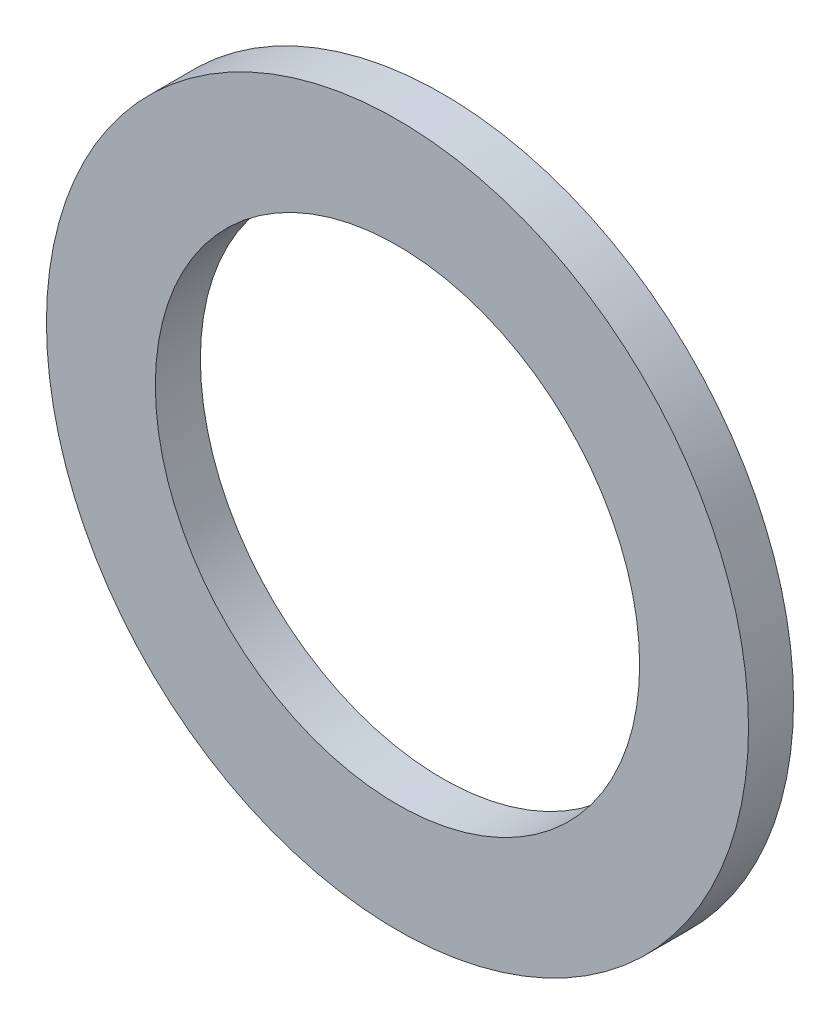
ISO-10303-21;
HEADER;
FILE_DESCRIPTION(('STEP AP214'),'2;1');
FILE_NAME('part.step','',(''),(''),'','','');
FILE_SCHEMA(('AUTOMOTIVE_DESIGN { 1 0 10303 214 1 1 1 1 }'));
ENDSEC;
DATA;
#1=APPLICATION_CONTEXT('core data for automotive mechanical design processes');
#2=APPLICATION_PROTOCOL_DEFINITION('international standard','automotive_design',2000,#1);
#3=PRODUCT_CONTEXT('',#1,'mechanical');
#4=PRODUCT('Part','Part','',(#3));
#5=PRODUCT_RELATED_PRODUCT_CATEGORY('part','',(#4));
#6=PRODUCT_DEFINITION_FORMATION('','',#4);
#7=PRODUCT_DEFINITION_CONTEXT('part definition',#1,'design');
#8=PRODUCT_DEFINITION('design','',#6,#7);
#9=PRODUCT_DEFINITION_SHAPE('','',#8);
#10=(LENGTH_UNIT() NAMED_UNIT(*) SI_UNIT(.MILLI.,.METRE.));
#11=(NAMED_UNIT(*) PLANE_ANGLE_UNIT() SI_UNIT($,.RADIAN.));
#12=(NAMED_UNIT(*) SI_UNIT($,.STERADIAN.) SOLID_ANGLE_UNIT());
#13=UNCERTAINTY_MEASURE_WITH_UNIT(LENGTH_MEASURE(1.E-05),#10,'distance_accuracy_value','');
#14=(GEOMETRIC_REPRESENTATION_CONTEXT(3) GLOBAL_UNCERTAINTY_ASSIGNED_CONTEXT((#13)) GLOBAL_UNIT_ASSIGNED_CONTEXT((#10,
#11,#12)) REPRESENTATION_CONTEXT('',''));
#15=CARTESIAN_POINT('',(0.,0.,0.));
#16=DIRECTION('',(0.,0.,1.));
#17=DIRECTION('',(1.,0.,0.));
#18=AXIS2_PLACEMENT_3D('',#15,#16,#17);
#19=CARTESIAN_POINT('',(0.,0.,0.3048));
#20=DIRECTION('',(0.,0.,1.));
#21=DIRECTION('',(1.,0.,0.));
#22=AXIS2_PLACEMENT_3D('',#19,#20,#21);
#23=PLANE('',#22);
#24=CARTESIAN_POINT('',(0.,0.,0.3048));
#25=DIRECTION('',(0.,0.,-1.));
#26=DIRECTION('',(-1.,0.,0.));
#27=AXIS2_PLACEMENT_3D('',#24,#25,#26);
#28=CIRCLE('',#27,1.6383);
#29=CARTESIAN_POINT('',(-1.6383,0.,0.3048));
#30=VERTEX_POINT('',#29);
#31=EDGE_CURVE('E27',#30,#30,#28,.T.);
#32=ORIENTED_EDGE('',*,*,#31,.T.);
#33=EDGE_LOOP('',(#32));
#34=FACE_BOUND('',#33,.T.);
#35=CARTESIAN_POINT('',(0.,0.,0.3048));
#36=DIRECTION('',(0.,0.,1.));
#37=DIRECTION('',(1.,0.,0.));
#38=AXIS2_PLACEMENT_3D('',#35,#36,#37);
#39=CIRCLE('',#38,2.3749);
#40=CARTESIAN_POINT('',(2.3749,0.,0.3048));
#41=VERTEX_POINT('',#40);
#42=EDGE_CURVE('E18',#41,#41,#39,.F.);
#43=ORIENTED_EDGE('',*,*,#42,.F.);
#44=EDGE_LOOP('',(#43));
#45=FACE_BOUND('',#44,.T.);
#46=ADVANCED_FACE('F15',(#34,#45),#23,.T.);
#47=CARTESIAN_POINT('',(0.,0.,0.));
#48=DIRECTION('',(0.,0.,1.));
#49=DIRECTION('',(1.,0.,0.));
#50=AXIS2_PLACEMENT_3D('',#47,#48,#49);
#51=CYLINDRICAL_SURFACE('',#50,2.3749);
#52=ORIENTED_EDGE('',*,*,#42,.T.);
#53=EDGE_LOOP('',(#52));
#54=FACE_BOUND('',#53,.T.);
#55=CARTESIAN_POINT('',(0.,0.,0.));
#56=DIRECTION('',(0.,0.,1.));
#57=DIRECTION('',(1.,0.,0.));
#58=AXIS2_PLACEMENT_3D('',#55,#56,#57);
#59=CIRCLE('',#58,2.3749);
#60=CARTESIAN_POINT('',(2.3749,0.,0.));
#61=VERTEX_POINT('',#60);
#62=EDGE_CURVE('E22',#61,#61,#59,.T.);
#63=ORIENTED_EDGE('',*,*,#62,.T.);
#64=EDGE_LOOP('',(#63));
#65=FACE_BOUND('',#64,.T.);
#66=ADVANCED_FACE('F35',(#54,#65),#51,.T.);
#67=CARTESIAN_POINT('',(0.,0.,0.));
#68=DIRECTION('',(0.,0.,-1.));
#69=DIRECTION('',(-1.,0.,0.));
#70=AXIS2_PLACEMENT_3D('',#67,#68,#69);
#71=CYLINDRICAL_SURFACE('',#70,1.6383);
#72=ORIENTED_EDGE('',*,*,#31,.F.);
#73=EDGE_LOOP('',(#72));
#74=FACE_BOUND('',#73,.T.);
#75=CARTESIAN_POINT('',(0.,0.,0.));
#76=DIRECTION('',(0.,0.,-1.));
#77=DIRECTION('',(-1.,0.,0.));
#78=AXIS2_PLACEMENT_3D('',#75,#76,#77);
#79=CIRCLE('',#78,1.6383);
#80=CARTESIAN_POINT('',(-1.6383,0.,0.));
#81=VERTEX_POINT('',#80);
#82=EDGE_CURVE('E10',#81,#81,#79,.T.);
#83=ORIENTED_EDGE('',*,*,#82,.T.);
#84=EDGE_LOOP('',(#83));
#85=FACE_BOUND('',#84,.T.);
#86=ADVANCED_FACE('F43',(#74,#85),#71,.F.);
#87=CARTESIAN_POINT('',(0.,0.,0.));
#88=DIRECTION('',(0.,0.,1.));
#89=DIRECTION('',(1.,0.,0.));
#90=AXIS2_PLACEMENT_3D('',#87,#88,#89);
#91=PLANE('',#90);
#92=ORIENTED_EDGE('',*,*,#82,.F.);
#93=EDGE_LOOP('',(#92));
#94=FACE_BOUND('',#93,.T.);
#95=ORIENTED_EDGE('',*,*,#62,.F.);
#96=EDGE_LOOP('',(#95));
#97=FACE_BOUND('',#96,.T.);
#98=ADVANCED_FACE('F44',(#94,#97),#91,.F.);
#99=CLOSED_SHELL('',(#46,#66,#86,#98));
#100=MANIFOLD_SOLID_BREP('B1',#99);
#101=ADVANCED_BREP_SHAPE_REPRESENTATION('',(#18,#100),#14);
#102=SHAPE_DEFINITION_REPRESENTATION(#9,#101);
ENDSEC;
END-ISO-10303-21;
